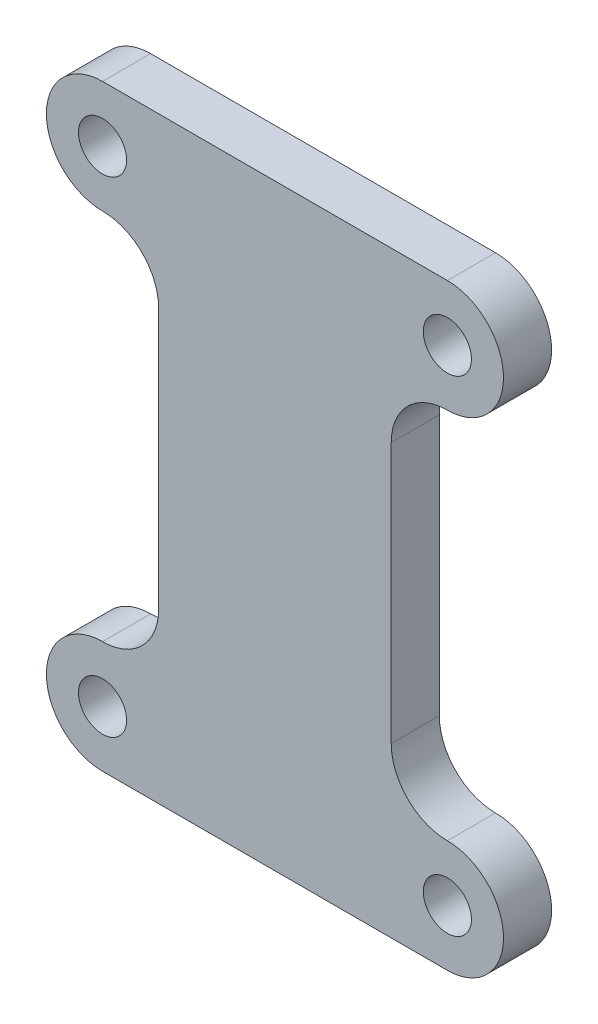
ISO-10303-21;
HEADER;
FILE_DESCRIPTION(('STEP AP214'),'2;1');
FILE_NAME('part.step','',(''),(''),'','','');
FILE_SCHEMA(('AUTOMOTIVE_DESIGN { 1 0 10303 214 1 1 1 1 }'));
ENDSEC;
DATA;
#1=APPLICATION_CONTEXT('core data for automotive mechanical design processes');
#2=APPLICATION_PROTOCOL_DEFINITION('international standard','automotive_design',2000,#1);
#3=PRODUCT_CONTEXT('',#1,'mechanical');
#4=PRODUCT('Part','Part','',(#3));
#5=PRODUCT_RELATED_PRODUCT_CATEGORY('part','',(#4));
#6=PRODUCT_DEFINITION_FORMATION('','',#4);
#7=PRODUCT_DEFINITION_CONTEXT('part definition',#1,'design');
#8=PRODUCT_DEFINITION('design','',#6,#7);
#9=PRODUCT_DEFINITION_SHAPE('','',#8);
#10=(LENGTH_UNIT() NAMED_UNIT(*) SI_UNIT(.MILLI.,.METRE.));
#11=(NAMED_UNIT(*) PLANE_ANGLE_UNIT() SI_UNIT($,.RADIAN.));
#12=(NAMED_UNIT(*) SI_UNIT($,.STERADIAN.) SOLID_ANGLE_UNIT());
#13=UNCERTAINTY_MEASURE_WITH_UNIT(LENGTH_MEASURE(1.E-05),#10,'distance_accuracy_value','');
#14=(GEOMETRIC_REPRESENTATION_CONTEXT(3) GLOBAL_UNCERTAINTY_ASSIGNED_CONTEXT((#13)) GLOBAL_UNIT_ASSIGNED_CONTEXT((#10,
#11,#12)) REPRESENTATION_CONTEXT('',''));
#15=CARTESIAN_POINT('',(0.,0.,0.));
#16=DIRECTION('',(0.,0.,1.));
#17=DIRECTION('',(1.,0.,0.));
#18=AXIS2_PLACEMENT_3D('',#15,#16,#17);
#19=CARTESIAN_POINT('',(-10.75,8.125,1.5));
#20=DIRECTION('',(0.,0.,-1.));
#21=DIRECTION('',(-1.,0.,0.));
#22=AXIS2_PLACEMENT_3D('',#19,#20,#21);
#23=PLANE('',#22);
#24=CARTESIAN_POINT('',(-10.75,8.125,1.5));
#25=DIRECTION('',(0.,0.,-1.));
#26=DIRECTION('',(-1.,0.,0.));
#27=AXIS2_PLACEMENT_3D('',#24,#25,#26);
#28=CIRCLE('',#27,3.5);
#29=CARTESIAN_POINT('',(-10.75,11.625,1.5));
#30=VERTEX_POINT('',#29);
#31=CARTESIAN_POINT('',(-7.24999999999999,8.125,1.5));
#32=VERTEX_POINT('',#31);
#33=EDGE_CURVE('E176',#30,#32,#28,.T.);
#34=ORIENTED_EDGE('',*,*,#33,.T.);
#35=DIRECTION('',(0.,-1.,0.));
#36=VECTOR('',#35,1.);
#37=CARTESIAN_POINT('',(-7.24999999999999,8.125,1.5));
#38=LINE('',#37,#36);
#39=CARTESIAN_POINT('',(-7.24999999999999,-8.12499999999999,1.5));
#40=VERTEX_POINT('',#39);
#41=EDGE_CURVE('E104',#32,#40,#38,.T.);
#42=ORIENTED_EDGE('',*,*,#41,.T.);
#43=CARTESIAN_POINT('',(-10.75,-8.12499999999999,1.5));
#44=DIRECTION('',(0.,0.,-1.));
#45=DIRECTION('',(1.,0.,0.));
#46=AXIS2_PLACEMENT_3D('',#43,#44,#45);
#47=CIRCLE('',#46,3.5);
#48=CARTESIAN_POINT('',(-10.75,-11.625,1.5));
#49=VERTEX_POINT('',#48);
#50=EDGE_CURVE('E203',#40,#49,#47,.T.);
#51=ORIENTED_EDGE('',*,*,#50,.T.);
#52=CARTESIAN_POINT('',(-10.75,-15.125,1.5));
#53=DIRECTION('',(0.,0.,1.));
#54=DIRECTION('',(1.,0.,0.));
#55=AXIS2_PLACEMENT_3D('',#52,#53,#54);
#56=CIRCLE('',#55,3.5);
#57=CARTESIAN_POINT('',(-10.75,-18.625,1.5));
#58=VERTEX_POINT('',#57);
#59=EDGE_CURVE('E222',#49,#58,#56,.T.);
#60=ORIENTED_EDGE('',*,*,#59,.T.);
#61=DIRECTION('',(1.,0.,0.));
#62=VECTOR('',#61,1.);
#63=CARTESIAN_POINT('',(-10.75,-18.625,1.5));
#64=LINE('',#63,#62);
#65=CARTESIAN_POINT('',(10.75,-18.625,1.5));
#66=VERTEX_POINT('',#65);
#67=EDGE_CURVE('E219',#58,#66,#64,.T.);
#68=ORIENTED_EDGE('',*,*,#67,.T.);
#69=CARTESIAN_POINT('',(10.75,-15.125,1.5));
#70=DIRECTION('',(0.,0.,1.));
#71=DIRECTION('',(1.,0.,0.));
#72=AXIS2_PLACEMENT_3D('',#69,#70,#71);
#73=CIRCLE('',#72,3.5);
#74=CARTESIAN_POINT('',(10.75,-11.625,1.5));
#75=VERTEX_POINT('',#74);
#76=EDGE_CURVE('E221',#66,#75,#73,.T.);
#77=ORIENTED_EDGE('',*,*,#76,.T.);
#78=CARTESIAN_POINT('',(10.75,-8.12499999999999,1.5));
#79=DIRECTION('',(0.,0.,-1.));
#80=DIRECTION('',(-1.,0.,0.));
#81=AXIS2_PLACEMENT_3D('',#78,#79,#80);
#82=CIRCLE('',#81,3.5);
#83=CARTESIAN_POINT('',(7.25,-8.12499999999999,1.5));
#84=VERTEX_POINT('',#83);
#85=EDGE_CURVE('E224',#75,#84,#82,.T.);
#86=ORIENTED_EDGE('',*,*,#85,.T.);
#87=DIRECTION('',(0.,1.,0.));
#88=VECTOR('',#87,1.);
#89=CARTESIAN_POINT('',(7.25,8.12500000000001,1.5));
#90=LINE('',#89,#88);
#91=CARTESIAN_POINT('',(7.25,8.12500000000001,1.5));
#92=VERTEX_POINT('',#91);
#93=EDGE_CURVE('E230',#84,#92,#90,.T.);
#94=ORIENTED_EDGE('',*,*,#93,.T.);
#95=CARTESIAN_POINT('',(10.75,8.12500000000001,1.5));
#96=DIRECTION('',(0.,0.,-1.));
#97=DIRECTION('',(1.,0.,0.));
#98=AXIS2_PLACEMENT_3D('',#95,#96,#97);
#99=CIRCLE('',#98,3.5);
#100=CARTESIAN_POINT('',(10.75,11.625,1.5));
#101=VERTEX_POINT('',#100);
#102=EDGE_CURVE('E135',#92,#101,#99,.T.);
#103=ORIENTED_EDGE('',*,*,#102,.T.);
#104=CARTESIAN_POINT('',(10.75,15.125,1.5));
#105=DIRECTION('',(0.,0.,1.));
#106=DIRECTION('',(-1.,0.,0.));
#107=AXIS2_PLACEMENT_3D('',#104,#105,#106);
#108=CIRCLE('',#107,3.5);
#109=CARTESIAN_POINT('',(10.75,18.625,1.5));
#110=VERTEX_POINT('',#109);
#111=EDGE_CURVE('E129',#101,#110,#108,.T.);
#112=ORIENTED_EDGE('',*,*,#111,.T.);
#113=DIRECTION('',(-1.,0.,0.));
#114=VECTOR('',#113,1.);
#115=CARTESIAN_POINT('',(-10.75,18.625,1.5));
#116=LINE('',#115,#114);
#117=CARTESIAN_POINT('',(-10.75,18.625,1.5));
#118=VERTEX_POINT('',#117);
#119=EDGE_CURVE('E133',#110,#118,#116,.T.);
#120=ORIENTED_EDGE('',*,*,#119,.T.);
#121=CARTESIAN_POINT('',(-10.75,15.125,1.5));
#122=DIRECTION('',(0.,0.,1.));
#123=DIRECTION('',(-1.,0.,0.));
#124=AXIS2_PLACEMENT_3D('',#121,#122,#123);
#125=CIRCLE('',#124,3.5);
#126=EDGE_CURVE('E49',#118,#30,#125,.T.);
#127=ORIENTED_EDGE('',*,*,#126,.T.);
#128=EDGE_LOOP('',(#34,#42,#51,#60,#68,#77,#86,#94,#103,#112,#120,#127));
#129=FACE_BOUND('',#128,.T.);
#130=CARTESIAN_POINT('',(10.75,15.125,1.5));
#131=DIRECTION('',(0.,0.,1.));
#132=DIRECTION('',(1.,0.,0.));
#133=AXIS2_PLACEMENT_3D('',#130,#131,#132);
#134=CIRCLE('',#133,1.5);
#135=CARTESIAN_POINT('',(12.25,15.125,1.5));
#136=VERTEX_POINT('',#135);
#137=EDGE_CURVE('E157',#136,#136,#134,.T.);
#138=ORIENTED_EDGE('',*,*,#137,.F.);
#139=EDGE_LOOP('',(#138));
#140=FACE_BOUND('',#139,.T.);
#141=CARTESIAN_POINT('',(-10.75,15.125,1.5));
#142=DIRECTION('',(0.,0.,1.));
#143=DIRECTION('',(1.,0.,0.));
#144=AXIS2_PLACEMENT_3D('',#141,#142,#143);
#145=CIRCLE('',#144,1.5);
#146=CARTESIAN_POINT('',(-9.25,15.125,1.5));
#147=VERTEX_POINT('',#146);
#148=EDGE_CURVE('E294',#147,#147,#145,.T.);
#149=ORIENTED_EDGE('',*,*,#148,.F.);
#150=EDGE_LOOP('',(#149));
#151=FACE_BOUND('',#150,.T.);
#152=CARTESIAN_POINT('',(10.75,-15.125,1.5));
#153=DIRECTION('',(0.,0.,1.));
#154=DIRECTION('',(1.,0.,0.));
#155=AXIS2_PLACEMENT_3D('',#152,#153,#154);
#156=CIRCLE('',#155,1.5);
#157=CARTESIAN_POINT('',(12.25,-15.125,1.5));
#158=VERTEX_POINT('',#157);
#159=EDGE_CURVE('E288',#158,#158,#156,.T.);
#160=ORIENTED_EDGE('',*,*,#159,.F.);
#161=EDGE_LOOP('',(#160));
#162=FACE_BOUND('',#161,.T.);
#163=CARTESIAN_POINT('',(-10.75,-15.125,1.5));
#164=DIRECTION('',(0.,0.,1.));
#165=DIRECTION('',(1.,0.,0.));
#166=AXIS2_PLACEMENT_3D('',#163,#164,#165);
#167=CIRCLE('',#166,1.5);
#168=CARTESIAN_POINT('',(-9.25,-15.125,1.5));
#169=VERTEX_POINT('',#168);
#170=EDGE_CURVE('E279',#169,#169,#167,.T.);
#171=ORIENTED_EDGE('',*,*,#170,.F.);
#172=EDGE_LOOP('',(#171));
#173=FACE_BOUND('',#172,.T.);
#174=ADVANCED_FACE('F32',(#129,#140,#151,#162,#173),#23,.F.);
#175=CARTESIAN_POINT('',(-10.75,8.125,-1.5));
#176=DIRECTION('',(0.,0.,-1.));
#177=DIRECTION('',(-1.,0.,0.));
#178=AXIS2_PLACEMENT_3D('',#175,#176,#177);
#179=PLANE('',#178);
#180=CARTESIAN_POINT('',(10.75,-15.125,-1.5));
#181=DIRECTION('',(0.,0.,1.));
#182=DIRECTION('',(1.,0.,0.));
#183=AXIS2_PLACEMENT_3D('',#180,#181,#182);
#184=CIRCLE('',#183,1.5);
#185=CARTESIAN_POINT('',(12.25,-15.125,-1.5));
#186=VERTEX_POINT('',#185);
#187=EDGE_CURVE('E285',#186,#186,#184,.T.);
#188=ORIENTED_EDGE('',*,*,#187,.T.);
#189=EDGE_LOOP('',(#188));
#190=FACE_BOUND('',#189,.T.);
#191=CARTESIAN_POINT('',(10.75,15.125,-1.5));
#192=DIRECTION('',(0.,0.,1.));
#193=DIRECTION('',(1.,0.,0.));
#194=AXIS2_PLACEMENT_3D('',#191,#192,#193);
#195=CIRCLE('',#194,1.5);
#196=CARTESIAN_POINT('',(12.25,15.125,-1.5));
#197=VERTEX_POINT('',#196);
#198=EDGE_CURVE('E297',#197,#197,#195,.T.);
#199=ORIENTED_EDGE('',*,*,#198,.T.);
#200=EDGE_LOOP('',(#199));
#201=FACE_BOUND('',#200,.T.);
#202=CARTESIAN_POINT('',(-10.75,8.125,-1.5));
#203=DIRECTION('',(0.,0.,-1.));
#204=DIRECTION('',(-1.,0.,0.));
#205=AXIS2_PLACEMENT_3D('',#202,#203,#204);
#206=CIRCLE('',#205,3.5);
#207=CARTESIAN_POINT('',(-10.75,11.625,-1.5));
#208=VERTEX_POINT('',#207);
#209=CARTESIAN_POINT('',(-7.24999999999999,8.125,-1.5));
#210=VERTEX_POINT('',#209);
#211=EDGE_CURVE('E153',#208,#210,#206,.T.);
#212=ORIENTED_EDGE('',*,*,#211,.F.);
#213=CARTESIAN_POINT('',(-10.75,15.125,-1.5));
#214=DIRECTION('',(0.,0.,1.));
#215=DIRECTION('',(-1.,0.,0.));
#216=AXIS2_PLACEMENT_3D('',#213,#214,#215);
#217=CIRCLE('',#216,3.5);
#218=CARTESIAN_POINT('',(-10.75,18.625,-1.5));
#219=VERTEX_POINT('',#218);
#220=EDGE_CURVE('E96',#219,#208,#217,.T.);
#221=ORIENTED_EDGE('',*,*,#220,.F.);
#222=DIRECTION('',(-1.,0.,0.));
#223=VECTOR('',#222,1.);
#224=CARTESIAN_POINT('',(-10.75,18.625,-1.5));
#225=LINE('',#224,#223);
#226=CARTESIAN_POINT('',(10.75,18.625,-1.5));
#227=VERTEX_POINT('',#226);
#228=EDGE_CURVE('E90',#227,#219,#225,.T.);
#229=ORIENTED_EDGE('',*,*,#228,.F.);
#230=CARTESIAN_POINT('',(10.75,15.125,-1.5));
#231=DIRECTION('',(0.,0.,1.));
#232=DIRECTION('',(-1.,0.,0.));
#233=AXIS2_PLACEMENT_3D('',#230,#231,#232);
#234=CIRCLE('',#233,3.5);
#235=CARTESIAN_POINT('',(10.75,11.625,-1.5));
#236=VERTEX_POINT('',#235);
#237=EDGE_CURVE('E143',#236,#227,#234,.T.);
#238=ORIENTED_EDGE('',*,*,#237,.F.);
#239=CARTESIAN_POINT('',(10.75,8.12500000000001,-1.5));
#240=DIRECTION('',(0.,0.,-1.));
#241=DIRECTION('',(1.,0.,0.));
#242=AXIS2_PLACEMENT_3D('',#239,#240,#241);
#243=CIRCLE('',#242,3.5);
#244=CARTESIAN_POINT('',(7.25,8.12500000000001,-1.5));
#245=VERTEX_POINT('',#244);
#246=EDGE_CURVE('E171',#245,#236,#243,.T.);
#247=ORIENTED_EDGE('',*,*,#246,.F.);
#248=DIRECTION('',(0.,1.,0.));
#249=VECTOR('',#248,1.);
#250=CARTESIAN_POINT('',(7.25,8.12500000000001,-1.5));
#251=LINE('',#250,#249);
#252=CARTESIAN_POINT('',(7.25,-8.12499999999999,-1.5));
#253=VERTEX_POINT('',#252);
#254=EDGE_CURVE('E169',#253,#245,#251,.T.);
#255=ORIENTED_EDGE('',*,*,#254,.F.);
#256=CARTESIAN_POINT('',(10.75,-8.12499999999999,-1.5));
#257=DIRECTION('',(0.,0.,-1.));
#258=DIRECTION('',(-1.,0.,0.));
#259=AXIS2_PLACEMENT_3D('',#256,#257,#258);
#260=CIRCLE('',#259,3.5);
#261=CARTESIAN_POINT('',(10.75,-11.625,-1.5));
#262=VERTEX_POINT('',#261);
#263=EDGE_CURVE('E167',#262,#253,#260,.T.);
#264=ORIENTED_EDGE('',*,*,#263,.F.);
#265=CARTESIAN_POINT('',(10.75,-15.125,-1.5));
#266=DIRECTION('',(0.,0.,1.));
#267=DIRECTION('',(1.,0.,0.));
#268=AXIS2_PLACEMENT_3D('',#265,#266,#267);
#269=CIRCLE('',#268,3.5);
#270=CARTESIAN_POINT('',(10.75,-18.625,-1.5));
#271=VERTEX_POINT('',#270);
#272=EDGE_CURVE('E165',#271,#262,#269,.T.);
#273=ORIENTED_EDGE('',*,*,#272,.F.);
#274=DIRECTION('',(1.,0.,0.));
#275=VECTOR('',#274,1.);
#276=CARTESIAN_POINT('',(-10.75,-18.625,-1.5));
#277=LINE('',#276,#275);
#278=CARTESIAN_POINT('',(-10.75,-18.625,-1.5));
#279=VERTEX_POINT('',#278);
#280=EDGE_CURVE('E163',#279,#271,#277,.T.);
#281=ORIENTED_EDGE('',*,*,#280,.F.);
#282=CARTESIAN_POINT('',(-10.75,-15.125,-1.5));
#283=DIRECTION('',(0.,0.,1.));
#284=DIRECTION('',(1.,0.,0.));
#285=AXIS2_PLACEMENT_3D('',#282,#283,#284);
#286=CIRCLE('',#285,3.5);
#287=CARTESIAN_POINT('',(-10.75,-11.625,-1.5));
#288=VERTEX_POINT('',#287);
#289=EDGE_CURVE('E161',#288,#279,#286,.T.);
#290=ORIENTED_EDGE('',*,*,#289,.F.);
#291=CARTESIAN_POINT('',(-10.75,-8.12499999999999,-1.5));
#292=DIRECTION('',(0.,0.,-1.));
#293=DIRECTION('',(1.,0.,0.));
#294=AXIS2_PLACEMENT_3D('',#291,#292,#293);
#295=CIRCLE('',#294,3.5);
#296=CARTESIAN_POINT('',(-7.24999999999999,-8.12499999999999,-1.5));
#297=VERTEX_POINT('',#296);
#298=EDGE_CURVE('E159',#297,#288,#295,.T.);
#299=ORIENTED_EDGE('',*,*,#298,.F.);
#300=DIRECTION('',(0.,-1.,0.));
#301=VECTOR('',#300,1.);
#302=CARTESIAN_POINT('',(-7.24999999999999,8.125,-1.5));
#303=LINE('',#302,#301);
#304=EDGE_CURVE('E156',#210,#297,#303,.T.);
#305=ORIENTED_EDGE('',*,*,#304,.F.);
#306=EDGE_LOOP('',(#212,#221,#229,#238,#247,#255,#264,#273,#281,#290,#299,#305));
#307=FACE_BOUND('',#306,.T.);
#308=CARTESIAN_POINT('',(-10.75,15.125,-1.5));
#309=DIRECTION('',(0.,0.,1.));
#310=DIRECTION('',(1.,0.,0.));
#311=AXIS2_PLACEMENT_3D('',#308,#309,#310);
#312=CIRCLE('',#311,1.5);
#313=CARTESIAN_POINT('',(-9.25,15.125,-1.5));
#314=VERTEX_POINT('',#313);
#315=EDGE_CURVE('E291',#314,#314,#312,.T.);
#316=ORIENTED_EDGE('',*,*,#315,.T.);
#317=EDGE_LOOP('',(#316));
#318=FACE_BOUND('',#317,.T.);
#319=CARTESIAN_POINT('',(-10.75,-15.125,-1.5));
#320=DIRECTION('',(0.,0.,1.));
#321=DIRECTION('',(1.,0.,0.));
#322=AXIS2_PLACEMENT_3D('',#319,#320,#321);
#323=CIRCLE('',#322,1.5);
#324=CARTESIAN_POINT('',(-9.25,-15.125,-1.5));
#325=VERTEX_POINT('',#324);
#326=EDGE_CURVE('E282',#325,#325,#323,.T.);
#327=ORIENTED_EDGE('',*,*,#326,.T.);
#328=EDGE_LOOP('',(#327));
#329=FACE_BOUND('',#328,.T.);
#330=ADVANCED_FACE('F207',(#190,#201,#307,#318,#329),#179,.T.);
#331=CARTESIAN_POINT('',(-10.75,8.125,1.5));
#332=DIRECTION('',(0.,0.,-1.));
#333=DIRECTION('',(-1.,0.,0.));
#334=AXIS2_PLACEMENT_3D('',#331,#332,#333);
#335=CYLINDRICAL_SURFACE('',#334,3.5);
#336=ORIENTED_EDGE('',*,*,#211,.T.);
#337=DIRECTION('',(0.,0.,-1.));
#338=VECTOR('',#337,1.);
#339=CARTESIAN_POINT('',(-7.24999999999999,8.125,1.5));
#340=LINE('',#339,#338);
#341=EDGE_CURVE('E11',#32,#210,#340,.T.);
#342=ORIENTED_EDGE('',*,*,#341,.F.);
#343=ORIENTED_EDGE('',*,*,#33,.F.);
#344=DIRECTION('',(0.,0.,-1.));
#345=VECTOR('',#344,1.);
#346=CARTESIAN_POINT('',(-10.75,11.625,1.5));
#347=LINE('',#346,#345);
#348=EDGE_CURVE('E149',#30,#208,#347,.T.);
#349=ORIENTED_EDGE('',*,*,#348,.T.);
#350=EDGE_LOOP('',(#336,#342,#343,#349));
#351=FACE_BOUND('',#350,.T.);
#352=ADVANCED_FACE('F34',(#351),#335,.F.);
#353=CARTESIAN_POINT('',(-7.24999999999999,8.125,1.5));
#354=DIRECTION('',(1.,0.,0.));
#355=DIRECTION('',(0.,0.,-1.));
#356=AXIS2_PLACEMENT_3D('',#353,#354,#355);
#357=PLANE('',#356);
#358=ORIENTED_EDGE('',*,*,#304,.T.);
#359=DIRECTION('',(0.,0.,-1.));
#360=VECTOR('',#359,1.);
#361=CARTESIAN_POINT('',(-7.24999999999999,-8.12499999999999,1.5));
#362=LINE('',#361,#360);
#363=EDGE_CURVE('E41',#40,#297,#362,.T.);
#364=ORIENTED_EDGE('',*,*,#363,.F.);
#365=ORIENTED_EDGE('',*,*,#41,.F.);
#366=ORIENTED_EDGE('',*,*,#341,.T.);
#367=EDGE_LOOP('',(#358,#364,#365,#366));
#368=FACE_BOUND('',#367,.T.);
#369=ADVANCED_FACE('F409',(#368),#357,.F.);
#370=CARTESIAN_POINT('',(-10.75,-8.12499999999999,1.5));
#371=DIRECTION('',(0.,0.,-1.));
#372=DIRECTION('',(-1.,0.,0.));
#373=AXIS2_PLACEMENT_3D('',#370,#371,#372);
#374=CYLINDRICAL_SURFACE('',#373,3.5);
#375=ORIENTED_EDGE('',*,*,#298,.T.);
#376=DIRECTION('',(0.,0.,-1.));
#377=VECTOR('',#376,1.);
#378=CARTESIAN_POINT('',(-10.75,-11.625,1.5));
#379=LINE('',#378,#377);
#380=EDGE_CURVE('E195',#49,#288,#379,.T.);
#381=ORIENTED_EDGE('',*,*,#380,.F.);
#382=ORIENTED_EDGE('',*,*,#50,.F.);
#383=ORIENTED_EDGE('',*,*,#363,.T.);
#384=EDGE_LOOP('',(#375,#381,#382,#383));
#385=FACE_BOUND('',#384,.T.);
#386=ADVANCED_FACE('F201',(#385),#374,.F.);
#387=CARTESIAN_POINT('',(-10.75,-15.125,1.5));
#388=DIRECTION('',(0.,0.,-1.));
#389=DIRECTION('',(-1.,0.,0.));
#390=AXIS2_PLACEMENT_3D('',#387,#388,#389);
#391=CYLINDRICAL_SURFACE('',#390,3.5);
#392=ORIENTED_EDGE('',*,*,#289,.T.);
#393=DIRECTION('',(0.,0.,-1.));
#394=VECTOR('',#393,1.);
#395=CARTESIAN_POINT('',(-10.75,-18.625,1.5));
#396=LINE('',#395,#394);
#397=EDGE_CURVE('E192',#58,#279,#396,.T.);
#398=ORIENTED_EDGE('',*,*,#397,.F.);
#399=ORIENTED_EDGE('',*,*,#59,.F.);
#400=ORIENTED_EDGE('',*,*,#380,.T.);
#401=EDGE_LOOP('',(#392,#398,#399,#400));
#402=FACE_BOUND('',#401,.T.);
#403=ADVANCED_FACE('F213',(#402),#391,.T.);
#404=CARTESIAN_POINT('',(-10.75,-18.625,1.5));
#405=DIRECTION('',(0.,1.,0.));
#406=DIRECTION('',(-1.,0.,0.));
#407=AXIS2_PLACEMENT_3D('',#404,#405,#406);
#408=PLANE('',#407);
#409=ORIENTED_EDGE('',*,*,#280,.T.);
#410=DIRECTION('',(0.,0.,-1.));
#411=VECTOR('',#410,1.);
#412=CARTESIAN_POINT('',(10.75,-18.625,1.5));
#413=LINE('',#412,#411);
#414=EDGE_CURVE('E189',#66,#271,#413,.T.);
#415=ORIENTED_EDGE('',*,*,#414,.F.);
#416=ORIENTED_EDGE('',*,*,#67,.F.);
#417=ORIENTED_EDGE('',*,*,#397,.T.);
#418=EDGE_LOOP('',(#409,#415,#416,#417));
#419=FACE_BOUND('',#418,.T.);
#420=ADVANCED_FACE('F217',(#419),#408,.F.);
#421=CARTESIAN_POINT('',(10.75,-15.125,1.5));
#422=DIRECTION('',(0.,0.,-1.));
#423=DIRECTION('',(-1.,0.,0.));
#424=AXIS2_PLACEMENT_3D('',#421,#422,#423);
#425=CYLINDRICAL_SURFACE('',#424,3.5);
#426=ORIENTED_EDGE('',*,*,#272,.T.);
#427=DIRECTION('',(0.,0.,-1.));
#428=VECTOR('',#427,1.);
#429=CARTESIAN_POINT('',(10.75,-11.625,1.5));
#430=LINE('',#429,#428);
#431=EDGE_CURVE('E186',#75,#262,#430,.T.);
#432=ORIENTED_EDGE('',*,*,#431,.F.);
#433=ORIENTED_EDGE('',*,*,#76,.F.);
#434=ORIENTED_EDGE('',*,*,#414,.T.);
#435=EDGE_LOOP('',(#426,#432,#433,#434));
#436=FACE_BOUND('',#435,.T.);
#437=ADVANCED_FACE('F374',(#436),#425,.T.);
#438=CARTESIAN_POINT('',(10.75,-8.12499999999999,1.5));
#439=DIRECTION('',(0.,0.,-1.));
#440=DIRECTION('',(-1.,0.,0.));
#441=AXIS2_PLACEMENT_3D('',#438,#439,#440);
#442=CYLINDRICAL_SURFACE('',#441,3.5);
#443=ORIENTED_EDGE('',*,*,#263,.T.);
#444=DIRECTION('',(0.,0.,-1.));
#445=VECTOR('',#444,1.);
#446=CARTESIAN_POINT('',(7.25,-8.12499999999999,1.5));
#447=LINE('',#446,#445);
#448=EDGE_CURVE('E183',#84,#253,#447,.T.);
#449=ORIENTED_EDGE('',*,*,#448,.F.);
#450=ORIENTED_EDGE('',*,*,#85,.F.);
#451=ORIENTED_EDGE('',*,*,#431,.T.);
#452=EDGE_LOOP('',(#443,#449,#450,#451));
#453=FACE_BOUND('',#452,.T.);
#454=ADVANCED_FACE('F365',(#453),#442,.F.);
#455=CARTESIAN_POINT('',(7.25,8.12500000000001,1.5));
#456=DIRECTION('',(-1.,0.,0.));
#457=DIRECTION('',(0.,0.,1.));
#458=AXIS2_PLACEMENT_3D('',#455,#456,#457);
#459=PLANE('',#458);
#460=ORIENTED_EDGE('',*,*,#254,.T.);
#461=DIRECTION('',(0.,0.,-1.));
#462=VECTOR('',#461,1.);
#463=CARTESIAN_POINT('',(7.25,8.12500000000001,1.5));
#464=LINE('',#463,#462);
#465=EDGE_CURVE('E180',#92,#245,#464,.T.);
#466=ORIENTED_EDGE('',*,*,#465,.F.);
#467=ORIENTED_EDGE('',*,*,#93,.F.);
#468=ORIENTED_EDGE('',*,*,#448,.T.);
#469=EDGE_LOOP('',(#460,#466,#467,#468));
#470=FACE_BOUND('',#469,.T.);
#471=ADVANCED_FACE('F236',(#470),#459,.F.);
#472=CARTESIAN_POINT('',(10.75,8.12500000000001,1.5));
#473=DIRECTION('',(0.,0.,-1.));
#474=DIRECTION('',(-1.,0.,0.));
#475=AXIS2_PLACEMENT_3D('',#472,#473,#474);
#476=CYLINDRICAL_SURFACE('',#475,3.5);
#477=ORIENTED_EDGE('',*,*,#246,.T.);
#478=DIRECTION('',(0.,0.,-1.));
#479=VECTOR('',#478,1.);
#480=CARTESIAN_POINT('',(10.75,11.625,1.5));
#481=LINE('',#480,#479);
#482=EDGE_CURVE('E144',#101,#236,#481,.T.);
#483=ORIENTED_EDGE('',*,*,#482,.F.);
#484=ORIENTED_EDGE('',*,*,#102,.F.);
#485=ORIENTED_EDGE('',*,*,#465,.T.);
#486=EDGE_LOOP('',(#477,#483,#484,#485));
#487=FACE_BOUND('',#486,.T.);
#488=ADVANCED_FACE('F240',(#487),#476,.F.);
#489=CARTESIAN_POINT('',(10.75,15.125,1.5));
#490=DIRECTION('',(0.,0.,-1.));
#491=DIRECTION('',(-1.,0.,0.));
#492=AXIS2_PLACEMENT_3D('',#489,#490,#491);
#493=CYLINDRICAL_SURFACE('',#492,3.5);
#494=ORIENTED_EDGE('',*,*,#237,.T.);
#495=DIRECTION('',(0.,0.,-1.));
#496=VECTOR('',#495,1.);
#497=CARTESIAN_POINT('',(10.75,18.625,1.5));
#498=LINE('',#497,#496);
#499=EDGE_CURVE('E140',#110,#227,#498,.T.);
#500=ORIENTED_EDGE('',*,*,#499,.F.);
#501=ORIENTED_EDGE('',*,*,#111,.F.);
#502=ORIENTED_EDGE('',*,*,#482,.T.);
#503=EDGE_LOOP('',(#494,#500,#501,#502));
#504=FACE_BOUND('',#503,.T.);
#505=ADVANCED_FACE('F141',(#504),#493,.T.);
#506=CARTESIAN_POINT('',(-10.75,18.625,1.5));
#507=DIRECTION('',(0.,-1.,0.));
#508=DIRECTION('',(1.,0.,0.));
#509=AXIS2_PLACEMENT_3D('',#506,#507,#508);
#510=PLANE('',#509);
#511=ORIENTED_EDGE('',*,*,#228,.T.);
#512=DIRECTION('',(0.,0.,-1.));
#513=VECTOR('',#512,1.);
#514=CARTESIAN_POINT('',(-10.75,18.625,1.5));
#515=LINE('',#514,#513);
#516=EDGE_CURVE('E145',#118,#219,#515,.T.);
#517=ORIENTED_EDGE('',*,*,#516,.F.);
#518=ORIENTED_EDGE('',*,*,#119,.F.);
#519=ORIENTED_EDGE('',*,*,#499,.T.);
#520=EDGE_LOOP('',(#511,#517,#518,#519));
#521=FACE_BOUND('',#520,.T.);
#522=ADVANCED_FACE('F147',(#521),#510,.F.);
#523=CARTESIAN_POINT('',(-10.75,15.125,1.5));
#524=DIRECTION('',(0.,0.,-1.));
#525=DIRECTION('',(-1.,0.,0.));
#526=AXIS2_PLACEMENT_3D('',#523,#524,#525);
#527=CYLINDRICAL_SURFACE('',#526,3.5);
#528=ORIENTED_EDGE('',*,*,#220,.T.);
#529=ORIENTED_EDGE('',*,*,#348,.F.);
#530=ORIENTED_EDGE('',*,*,#126,.F.);
#531=ORIENTED_EDGE('',*,*,#516,.T.);
#532=EDGE_LOOP('',(#528,#529,#530,#531));
#533=FACE_BOUND('',#532,.T.);
#534=ADVANCED_FACE('F244',(#533),#527,.T.);
#535=CARTESIAN_POINT('',(10.75,15.125,1.5));
#536=DIRECTION('',(0.,0.,-1.));
#537=DIRECTION('',(-1.,0.,0.));
#538=AXIS2_PLACEMENT_3D('',#535,#536,#537);
#539=CYLINDRICAL_SURFACE('',#538,1.5);
#540=ORIENTED_EDGE('',*,*,#137,.T.);
#541=EDGE_LOOP('',(#540));
#542=FACE_BOUND('',#541,.T.);
#543=ORIENTED_EDGE('',*,*,#198,.F.);
#544=EDGE_LOOP('',(#543));
#545=FACE_BOUND('',#544,.T.);
#546=ADVANCED_FACE('F246',(#542,#545),#539,.F.);
#547=CARTESIAN_POINT('',(-10.75,15.125,1.5));
#548=DIRECTION('',(0.,0.,-1.));
#549=DIRECTION('',(-1.,0.,0.));
#550=AXIS2_PLACEMENT_3D('',#547,#548,#549);
#551=CYLINDRICAL_SURFACE('',#550,1.5);
#552=ORIENTED_EDGE('',*,*,#148,.T.);
#553=EDGE_LOOP('',(#552));
#554=FACE_BOUND('',#553,.T.);
#555=ORIENTED_EDGE('',*,*,#315,.F.);
#556=EDGE_LOOP('',(#555));
#557=FACE_BOUND('',#556,.T.);
#558=ADVANCED_FACE('F252',(#554,#557),#551,.F.);
#559=CARTESIAN_POINT('',(10.75,-15.125,1.5));
#560=DIRECTION('',(0.,0.,-1.));
#561=DIRECTION('',(-1.,0.,0.));
#562=AXIS2_PLACEMENT_3D('',#559,#560,#561);
#563=CYLINDRICAL_SURFACE('',#562,1.5);
#564=ORIENTED_EDGE('',*,*,#159,.T.);
#565=EDGE_LOOP('',(#564));
#566=FACE_BOUND('',#565,.T.);
#567=ORIENTED_EDGE('',*,*,#187,.F.);
#568=EDGE_LOOP('',(#567));
#569=FACE_BOUND('',#568,.T.);
#570=ADVANCED_FACE('F266',(#566,#569),#563,.F.);
#571=CARTESIAN_POINT('',(-10.75,-15.125,1.5));
#572=DIRECTION('',(0.,0.,-1.));
#573=DIRECTION('',(-1.,0.,0.));
#574=AXIS2_PLACEMENT_3D('',#571,#572,#573);
#575=CYLINDRICAL_SURFACE('',#574,1.5);
#576=ORIENTED_EDGE('',*,*,#170,.T.);
#577=EDGE_LOOP('',(#576));
#578=FACE_BOUND('',#577,.T.);
#579=ORIENTED_EDGE('',*,*,#326,.F.);
#580=EDGE_LOOP('',(#579));
#581=FACE_BOUND('',#580,.T.);
#582=ADVANCED_FACE('F270',(#578,#581),#575,.F.);
#583=CLOSED_SHELL('',(#174,#330,#352,#369,#386,#403,#420,#437,#454,#471,#488,#505,#522,#534,
#546,#558,#570,#582));
#584=MANIFOLD_SOLID_BREP('B2',#583);
#585=ADVANCED_BREP_SHAPE_REPRESENTATION('',(#18,#584),#14);
#586=SHAPE_DEFINITION_REPRESENTATION(#9,#585);
ENDSEC;
END-ISO-10303-21;
